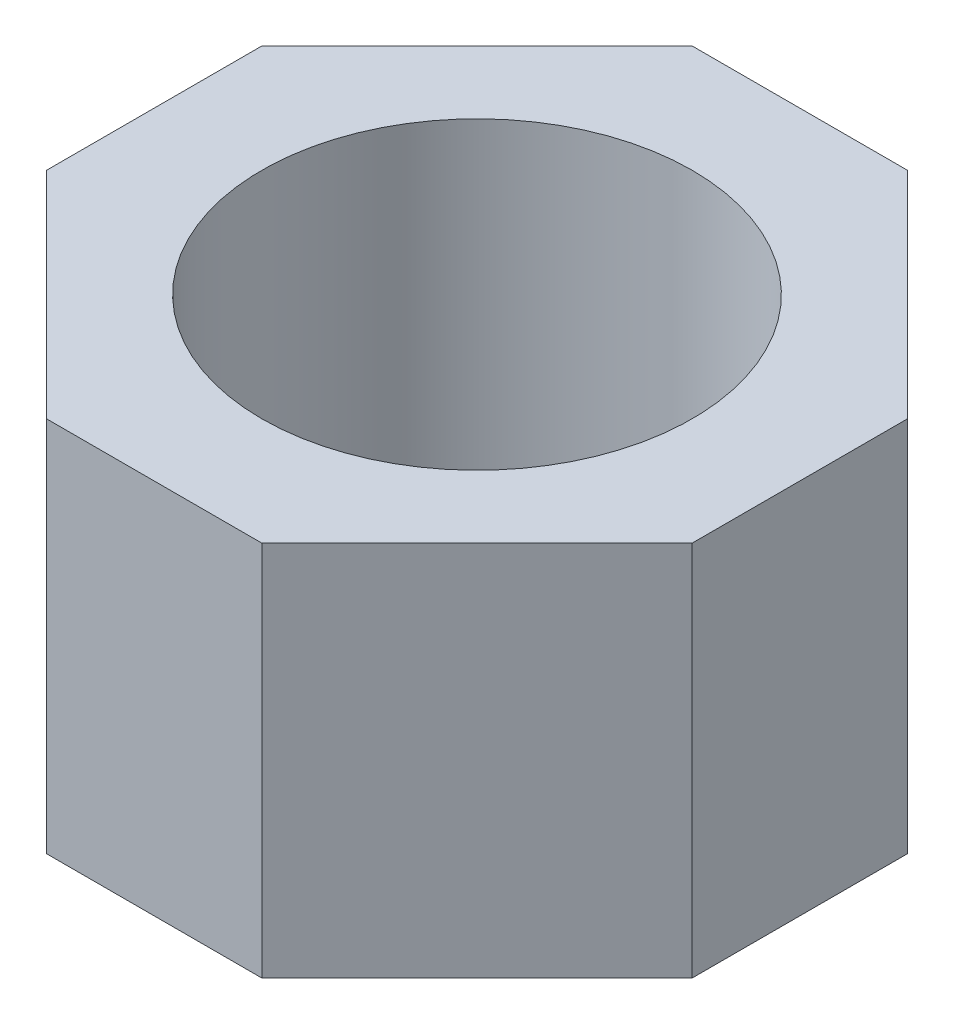
ISO-10303-21;
HEADER;
FILE_DESCRIPTION(('STEP AP214'),'2;1');
FILE_NAME('part.step','',(''),(''),'','','');
FILE_SCHEMA(('AUTOMOTIVE_DESIGN { 1 0 10303 214 1 1 1 1 }'));
ENDSEC;
DATA;
#1=APPLICATION_CONTEXT('core data for automotive mechanical design processes');
#2=APPLICATION_PROTOCOL_DEFINITION('international standard','automotive_design',2000,#1);
#3=PRODUCT_CONTEXT('',#1,'mechanical');
#4=PRODUCT('Part','Part','',(#3));
#5=PRODUCT_RELATED_PRODUCT_CATEGORY('part','',(#4));
#6=PRODUCT_DEFINITION_FORMATION('','',#4);
#7=PRODUCT_DEFINITION_CONTEXT('part definition',#1,'design');
#8=PRODUCT_DEFINITION('design','',#6,#7);
#9=PRODUCT_DEFINITION_SHAPE('','',#8);
#10=(LENGTH_UNIT() NAMED_UNIT(*) SI_UNIT(.MILLI.,.METRE.));
#11=(NAMED_UNIT(*) PLANE_ANGLE_UNIT() SI_UNIT($,.RADIAN.));
#12=(NAMED_UNIT(*) SI_UNIT($,.STERADIAN.) SOLID_ANGLE_UNIT());
#13=UNCERTAINTY_MEASURE_WITH_UNIT(LENGTH_MEASURE(1.E-05),#10,'distance_accuracy_value','');
#14=(GEOMETRIC_REPRESENTATION_CONTEXT(3) GLOBAL_UNCERTAINTY_ASSIGNED_CONTEXT((#13)) GLOBAL_UNIT_ASSIGNED_CONTEXT((#10,
#11,#12)) REPRESENTATION_CONTEXT('',''));
#15=CARTESIAN_POINT('',(0.,0.,0.));
#16=DIRECTION('',(0.,0.,1.));
#17=DIRECTION('',(1.,0.,0.));
#18=AXIS2_PLACEMENT_3D('',#15,#16,#17);
#19=CARTESIAN_POINT('',(9.99999999999999,35.,-30.));
#20=DIRECTION('',(0.,0.,1.));
#21=DIRECTION('',(1.,0.,0.));
#22=AXIS2_PLACEMENT_3D('',#19,#20,#21);
#23=PLANE('',#22);
#24=DIRECTION('',(-1.,0.,0.));
#25=VECTOR('',#24,1.);
#26=CARTESIAN_POINT('',(9.99999999999999,0.,-30.));
#27=LINE('',#26,#25);
#28=CARTESIAN_POINT('',(9.99999999999999,0.,-30.));
#29=VERTEX_POINT('',#28);
#30=CARTESIAN_POINT('',(-10.,0.,-30.));
#31=VERTEX_POINT('',#30);
#32=EDGE_CURVE('E129',#29,#31,#27,.T.);
#33=ORIENTED_EDGE('',*,*,#32,.T.);
#34=DIRECTION('',(0.,-1.,0.));
#35=VECTOR('',#34,1.);
#36=CARTESIAN_POINT('',(-10.,35.,-30.));
#37=LINE('',#36,#35);
#38=CARTESIAN_POINT('',(-10.,35.,-30.));
#39=VERTEX_POINT('',#38);
#40=EDGE_CURVE('E11',#39,#31,#37,.T.);
#41=ORIENTED_EDGE('',*,*,#40,.F.);
#42=DIRECTION('',(-1.,0.,0.));
#43=VECTOR('',#42,1.);
#44=CARTESIAN_POINT('',(9.99999999999999,35.,-30.));
#45=LINE('',#44,#43);
#46=CARTESIAN_POINT('',(9.99999999999999,35.,-30.));
#47=VERTEX_POINT('',#46);
#48=EDGE_CURVE('E144',#47,#39,#45,.T.);
#49=ORIENTED_EDGE('',*,*,#48,.F.);
#50=DIRECTION('',(0.,-1.,0.));
#51=VECTOR('',#50,1.);
#52=CARTESIAN_POINT('',(9.99999999999999,35.,-30.));
#53=LINE('',#52,#51);
#54=EDGE_CURVE('E125',#47,#29,#53,.T.);
#55=ORIENTED_EDGE('',*,*,#54,.T.);
#56=EDGE_LOOP('',(#33,#41,#49,#55));
#57=FACE_BOUND('',#56,.T.);
#58=ADVANCED_FACE('F33',(#57),#23,.F.);
#59=CARTESIAN_POINT('',(-10.,35.,-30.));
#60=DIRECTION('',(0.707106781186548,0.,0.707106781186548));
#61=DIRECTION('',(0.707106781186547,0.,-0.707106781186548));
#62=AXIS2_PLACEMENT_3D('',#59,#60,#61);
#63=PLANE('',#62);
#64=DIRECTION('',(-0.707106781186547,0.,0.707106781186548));
#65=VECTOR('',#64,1.);
#66=CARTESIAN_POINT('',(-10.,0.,-30.));
#67=LINE('',#66,#65);
#68=CARTESIAN_POINT('',(-30.,0.,-10.));
#69=VERTEX_POINT('',#68);
#70=EDGE_CURVE('E132',#31,#69,#67,.T.);
#71=ORIENTED_EDGE('',*,*,#70,.T.);
#72=DIRECTION('',(0.,-1.,0.));
#73=VECTOR('',#72,1.);
#74=CARTESIAN_POINT('',(-30.,35.,-10.));
#75=LINE('',#74,#73);
#76=CARTESIAN_POINT('',(-30.,35.,-10.));
#77=VERTEX_POINT('',#76);
#78=EDGE_CURVE('E41',#77,#69,#75,.T.);
#79=ORIENTED_EDGE('',*,*,#78,.F.);
#80=DIRECTION('',(-0.707106781186547,0.,0.707106781186548));
#81=VECTOR('',#80,1.);
#82=CARTESIAN_POINT('',(-10.,35.,-30.));
#83=LINE('',#82,#81);
#84=EDGE_CURVE('E92',#39,#77,#83,.T.);
#85=ORIENTED_EDGE('',*,*,#84,.F.);
#86=ORIENTED_EDGE('',*,*,#40,.T.);
#87=EDGE_LOOP('',(#71,#79,#85,#86));
#88=FACE_BOUND('',#87,.T.);
#89=ADVANCED_FACE('F200',(#88),#63,.F.);
#90=CARTESIAN_POINT('',(-30.,35.,-10.));
#91=DIRECTION('',(1.,0.,0.));
#92=DIRECTION('',(0.,0.,-1.));
#93=AXIS2_PLACEMENT_3D('',#90,#91,#92);
#94=PLANE('',#93);
#95=DIRECTION('',(0.,0.,1.));
#96=VECTOR('',#95,1.);
#97=CARTESIAN_POINT('',(-30.,0.,-10.));
#98=LINE('',#97,#96);
#99=CARTESIAN_POINT('',(-30.,0.,10.));
#100=VERTEX_POINT('',#99);
#101=EDGE_CURVE('E135',#69,#100,#98,.T.);
#102=ORIENTED_EDGE('',*,*,#101,.T.);
#103=DIRECTION('',(0.,-1.,0.));
#104=VECTOR('',#103,1.);
#105=CARTESIAN_POINT('',(-30.,35.,10.));
#106=LINE('',#105,#104);
#107=CARTESIAN_POINT('',(-30.,35.,10.));
#108=VERTEX_POINT('',#107);
#109=EDGE_CURVE('E151',#108,#100,#106,.T.);
#110=ORIENTED_EDGE('',*,*,#109,.F.);
#111=DIRECTION('',(0.,0.,1.));
#112=VECTOR('',#111,1.);
#113=CARTESIAN_POINT('',(-30.,35.,-10.));
#114=LINE('',#113,#112);
#115=EDGE_CURVE('E159',#77,#108,#114,.T.);
#116=ORIENTED_EDGE('',*,*,#115,.F.);
#117=ORIENTED_EDGE('',*,*,#78,.T.);
#118=EDGE_LOOP('',(#102,#110,#116,#117));
#119=FACE_BOUND('',#118,.T.);
#120=ADVANCED_FACE('F157',(#119),#94,.F.);
#121=CARTESIAN_POINT('',(-10.,35.,30.));
#122=DIRECTION('',(0.707106781186547,0.,-0.707106781186548));
#123=DIRECTION('',(-0.707106781186548,0.,-0.707106781186547));
#124=AXIS2_PLACEMENT_3D('',#121,#122,#123);
#125=PLANE('',#124);
#126=DIRECTION('',(0.707106781186548,0.,0.707106781186547));
#127=VECTOR('',#126,1.);
#128=CARTESIAN_POINT('',(-10.,0.,30.));
#129=LINE('',#128,#127);
#130=CARTESIAN_POINT('',(-10.,0.,30.));
#131=VERTEX_POINT('',#130);
#132=EDGE_CURVE('E137',#100,#131,#129,.T.);
#133=ORIENTED_EDGE('',*,*,#132,.T.);
#134=DIRECTION('',(0.,-1.,0.));
#135=VECTOR('',#134,1.);
#136=CARTESIAN_POINT('',(-10.,35.,30.));
#137=LINE('',#136,#135);
#138=CARTESIAN_POINT('',(-10.,35.,30.));
#139=VERTEX_POINT('',#138);
#140=EDGE_CURVE('E148',#139,#131,#137,.T.);
#141=ORIENTED_EDGE('',*,*,#140,.F.);
#142=DIRECTION('',(0.707106781186548,0.,0.707106781186547));
#143=VECTOR('',#142,1.);
#144=CARTESIAN_POINT('',(-10.,35.,30.));
#145=LINE('',#144,#143);
#146=EDGE_CURVE('E171',#108,#139,#145,.T.);
#147=ORIENTED_EDGE('',*,*,#146,.F.);
#148=ORIENTED_EDGE('',*,*,#109,.T.);
#149=EDGE_LOOP('',(#133,#141,#147,#148));
#150=FACE_BOUND('',#149,.T.);
#151=ADVANCED_FACE('F167',(#150),#125,.F.);
#152=CARTESIAN_POINT('',(10.,35.,30.));
#153=DIRECTION('',(0.,0.,-1.));
#154=DIRECTION('',(-1.,0.,0.));
#155=AXIS2_PLACEMENT_3D('',#152,#153,#154);
#156=PLANE('',#155);
#157=DIRECTION('',(1.,0.,0.));
#158=VECTOR('',#157,1.);
#159=CARTESIAN_POINT('',(10.,0.,30.));
#160=LINE('',#159,#158);
#161=CARTESIAN_POINT('',(10.,0.,30.));
#162=VERTEX_POINT('',#161);
#163=EDGE_CURVE('E139',#131,#162,#160,.T.);
#164=ORIENTED_EDGE('',*,*,#163,.T.);
#165=DIRECTION('',(0.,-1.,0.));
#166=VECTOR('',#165,1.);
#167=CARTESIAN_POINT('',(10.,35.,30.));
#168=LINE('',#167,#166);
#169=CARTESIAN_POINT('',(10.,35.,30.));
#170=VERTEX_POINT('',#169);
#171=EDGE_CURVE('E120',#170,#162,#168,.T.);
#172=ORIENTED_EDGE('',*,*,#171,.F.);
#173=DIRECTION('',(1.,0.,0.));
#174=VECTOR('',#173,1.);
#175=CARTESIAN_POINT('',(10.,35.,30.));
#176=LINE('',#175,#174);
#177=EDGE_CURVE('E111',#139,#170,#176,.T.);
#178=ORIENTED_EDGE('',*,*,#177,.F.);
#179=ORIENTED_EDGE('',*,*,#140,.T.);
#180=EDGE_LOOP('',(#164,#172,#178,#179));
#181=FACE_BOUND('',#180,.T.);
#182=ADVANCED_FACE('F170',(#181),#156,.F.);
#183=CARTESIAN_POINT('',(30.,35.,10.));
#184=DIRECTION('',(-0.707106781186548,0.,-0.707106781186548));
#185=DIRECTION('',(-0.707106781186548,0.,0.707106781186548));
#186=AXIS2_PLACEMENT_3D('',#183,#184,#185);
#187=PLANE('',#186);
#188=DIRECTION('',(0.707106781186548,0.,-0.707106781186548));
#189=VECTOR('',#188,1.);
#190=CARTESIAN_POINT('',(30.,0.,10.));
#191=LINE('',#190,#189);
#192=CARTESIAN_POINT('',(30.,0.,10.));
#193=VERTEX_POINT('',#192);
#194=EDGE_CURVE('E119',#162,#193,#191,.T.);
#195=ORIENTED_EDGE('',*,*,#194,.T.);
#196=DIRECTION('',(0.,-1.,0.));
#197=VECTOR('',#196,1.);
#198=CARTESIAN_POINT('',(30.,35.,10.));
#199=LINE('',#198,#197);
#200=CARTESIAN_POINT('',(30.,35.,10.));
#201=VERTEX_POINT('',#200);
#202=EDGE_CURVE('E116',#201,#193,#199,.T.);
#203=ORIENTED_EDGE('',*,*,#202,.F.);
#204=DIRECTION('',(0.707106781186548,0.,-0.707106781186548));
#205=VECTOR('',#204,1.);
#206=CARTESIAN_POINT('',(30.,35.,10.));
#207=LINE('',#206,#205);
#208=EDGE_CURVE('E105',#170,#201,#207,.T.);
#209=ORIENTED_EDGE('',*,*,#208,.F.);
#210=ORIENTED_EDGE('',*,*,#171,.T.);
#211=EDGE_LOOP('',(#195,#203,#209,#210));
#212=FACE_BOUND('',#211,.T.);
#213=ADVANCED_FACE('F117',(#212),#187,.F.);
#214=CARTESIAN_POINT('',(30.,35.,-10.));
#215=DIRECTION('',(-1.,0.,0.));
#216=DIRECTION('',(0.,0.,1.));
#217=AXIS2_PLACEMENT_3D('',#214,#215,#216);
#218=PLANE('',#217);
#219=DIRECTION('',(0.,0.,-1.));
#220=VECTOR('',#219,1.);
#221=CARTESIAN_POINT('',(30.,0.,-10.));
#222=LINE('',#221,#220);
#223=CARTESIAN_POINT('',(30.,0.,-10.));
#224=VERTEX_POINT('',#223);
#225=EDGE_CURVE('E78',#193,#224,#222,.T.);
#226=ORIENTED_EDGE('',*,*,#225,.T.);
#227=DIRECTION('',(0.,-1.,0.));
#228=VECTOR('',#227,1.);
#229=CARTESIAN_POINT('',(30.,35.,-10.));
#230=LINE('',#229,#228);
#231=CARTESIAN_POINT('',(30.,35.,-10.));
#232=VERTEX_POINT('',#231);
#233=EDGE_CURVE('E121',#232,#224,#230,.T.);
#234=ORIENTED_EDGE('',*,*,#233,.F.);
#235=DIRECTION('',(0.,0.,-1.));
#236=VECTOR('',#235,1.);
#237=CARTESIAN_POINT('',(30.,35.,-10.));
#238=LINE('',#237,#236);
#239=EDGE_CURVE('E109',#201,#232,#238,.T.);
#240=ORIENTED_EDGE('',*,*,#239,.F.);
#241=ORIENTED_EDGE('',*,*,#202,.T.);
#242=EDGE_LOOP('',(#226,#234,#240,#241));
#243=FACE_BOUND('',#242,.T.);
#244=ADVANCED_FACE('F123',(#243),#218,.F.);
#245=CARTESIAN_POINT('',(30.,35.,-10.));
#246=DIRECTION('',(-0.707106781186547,0.,0.707106781186548));
#247=DIRECTION('',(0.707106781186548,0.,0.707106781186547));
#248=AXIS2_PLACEMENT_3D('',#245,#246,#247);
#249=PLANE('',#248);
#250=DIRECTION('',(-0.707106781186548,0.,-0.707106781186547));
#251=VECTOR('',#250,1.);
#252=CARTESIAN_POINT('',(30.,0.,-10.));
#253=LINE('',#252,#251);
#254=EDGE_CURVE('E84',#224,#29,#253,.T.);
#255=ORIENTED_EDGE('',*,*,#254,.T.);
#256=ORIENTED_EDGE('',*,*,#54,.F.);
#257=DIRECTION('',(-0.707106781186548,0.,-0.707106781186547));
#258=VECTOR('',#257,1.);
#259=CARTESIAN_POINT('',(30.,35.,-10.));
#260=LINE('',#259,#258);
#261=EDGE_CURVE('E49',#232,#47,#260,.T.);
#262=ORIENTED_EDGE('',*,*,#261,.F.);
#263=ORIENTED_EDGE('',*,*,#233,.T.);
#264=EDGE_LOOP('',(#255,#256,#262,#263));
#265=FACE_BOUND('',#264,.T.);
#266=ADVANCED_FACE('F191',(#265),#249,.F.);
#267=CARTESIAN_POINT('',(0.,35.,0.));
#268=DIRECTION('',(0.,1.,0.));
#269=DIRECTION('',(0.,0.,1.));
#270=AXIS2_PLACEMENT_3D('',#267,#268,#269);
#271=PLANE('',#270);
#272=CARTESIAN_POINT('',(0.,35.,0.));
#273=DIRECTION('',(0.,1.,0.));
#274=DIRECTION('',(0.,0.,1.));
#275=AXIS2_PLACEMENT_3D('',#272,#273,#274);
#276=CIRCLE('',#275,20.);
#277=CARTESIAN_POINT('',(0.,35.,20.));
#278=VERTEX_POINT('',#277);
#279=EDGE_CURVE('E177',#278,#278,#276,.T.);
#280=ORIENTED_EDGE('',*,*,#279,.F.);
#281=EDGE_LOOP('',(#280));
#282=FACE_BOUND('',#281,.T.);
#283=ORIENTED_EDGE('',*,*,#48,.T.);
#284=ORIENTED_EDGE('',*,*,#84,.T.);
#285=ORIENTED_EDGE('',*,*,#115,.T.);
#286=ORIENTED_EDGE('',*,*,#146,.T.);
#287=ORIENTED_EDGE('',*,*,#177,.T.);
#288=ORIENTED_EDGE('',*,*,#208,.T.);
#289=ORIENTED_EDGE('',*,*,#239,.T.);
#290=ORIENTED_EDGE('',*,*,#261,.T.);
#291=EDGE_LOOP('',(#283,#284,#285,#286,#287,#288,#289,#290));
#292=FACE_BOUND('',#291,.T.);
#293=ADVANCED_FACE('F107',(#282,#292),#271,.T.);
#294=CARTESIAN_POINT('',(0.,0.,0.));
#295=DIRECTION('',(0.,1.,0.));
#296=DIRECTION('',(0.,0.,1.));
#297=AXIS2_PLACEMENT_3D('',#294,#295,#296);
#298=PLANE('',#297);
#299=CARTESIAN_POINT('',(0.,0.,0.));
#300=DIRECTION('',(0.,1.,0.));
#301=DIRECTION('',(0.,0.,1.));
#302=AXIS2_PLACEMENT_3D('',#299,#300,#301);
#303=CIRCLE('',#302,20.);
#304=CARTESIAN_POINT('',(0.,0.,20.));
#305=VERTEX_POINT('',#304);
#306=EDGE_CURVE('E133',#305,#305,#303,.T.);
#307=ORIENTED_EDGE('',*,*,#306,.T.);
#308=EDGE_LOOP('',(#307));
#309=FACE_BOUND('',#308,.T.);
#310=ORIENTED_EDGE('',*,*,#32,.F.);
#311=ORIENTED_EDGE('',*,*,#254,.F.);
#312=ORIENTED_EDGE('',*,*,#225,.F.);
#313=ORIENTED_EDGE('',*,*,#194,.F.);
#314=ORIENTED_EDGE('',*,*,#163,.F.);
#315=ORIENTED_EDGE('',*,*,#132,.F.);
#316=ORIENTED_EDGE('',*,*,#101,.F.);
#317=ORIENTED_EDGE('',*,*,#70,.F.);
#318=EDGE_LOOP('',(#310,#311,#312,#313,#314,#315,#316,#317));
#319=FACE_BOUND('',#318,.T.);
#320=ADVANCED_FACE('F163',(#309,#319),#298,.F.);
#321=CARTESIAN_POINT('',(0.,0.,0.));
#322=DIRECTION('',(0.,1.,0.));
#323=DIRECTION('',(0.,0.,1.));
#324=AXIS2_PLACEMENT_3D('',#321,#322,#323);
#325=CYLINDRICAL_SURFACE('',#324,20.);
#326=ORIENTED_EDGE('',*,*,#306,.F.);
#327=EDGE_LOOP('',(#326));
#328=FACE_BOUND('',#327,.T.);
#329=ORIENTED_EDGE('',*,*,#279,.T.);
#330=EDGE_LOOP('',(#329));
#331=FACE_BOUND('',#330,.T.);
#332=ADVANCED_FACE('F184',(#328,#331),#325,.F.);
#333=CLOSED_SHELL('',(#58,#89,#120,#151,#182,#213,#244,#266,#293,#320,#332));
#334=MANIFOLD_SOLID_BREP('B2',#333);
#335=ADVANCED_BREP_SHAPE_REPRESENTATION('',(#18,#334),#14);
#336=SHAPE_DEFINITION_REPRESENTATION(#9,#335);
ENDSEC;
END-ISO-10303-21;
